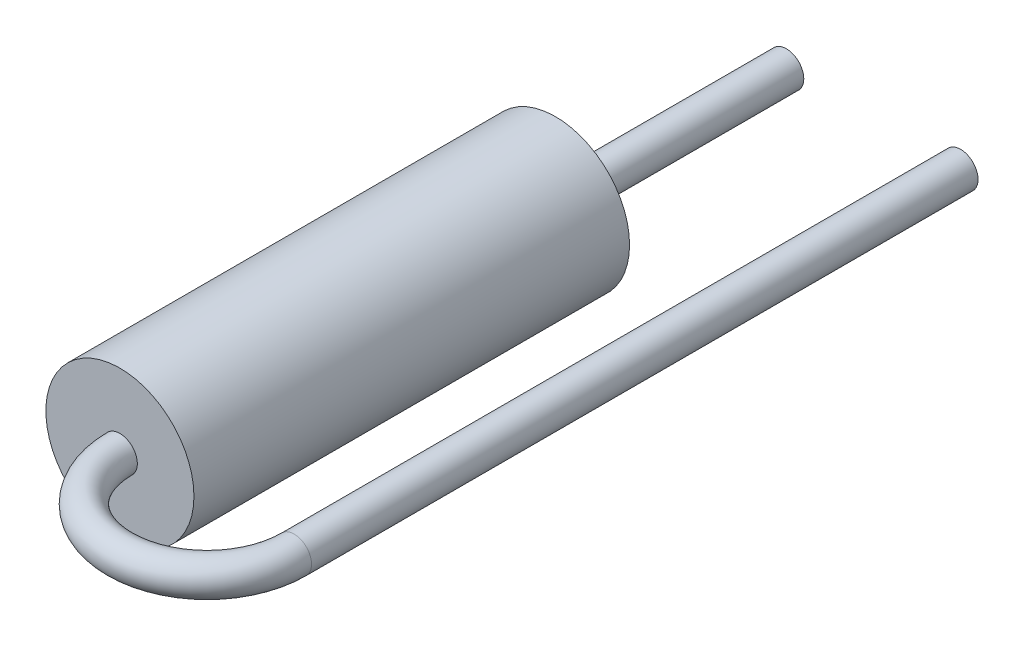
ISO-10303-21;
HEADER;
FILE_DESCRIPTION(('STEP AP214'),'2;1');
FILE_NAME('part.step','',(''),(''),'','','');
FILE_SCHEMA(('AUTOMOTIVE_DESIGN { 1 0 10303 214 1 1 1 1 }'));
ENDSEC;
DATA;
#1=APPLICATION_CONTEXT('core data for automotive mechanical design processes');
#2=APPLICATION_PROTOCOL_DEFINITION('international standard','automotive_design',2000,#1);
#3=PRODUCT_CONTEXT('',#1,'mechanical');
#4=PRODUCT('Part','Part','',(#3));
#5=PRODUCT_RELATED_PRODUCT_CATEGORY('part','',(#4));
#6=PRODUCT_DEFINITION_FORMATION('','',#4);
#7=PRODUCT_DEFINITION_CONTEXT('part definition',#1,'design');
#8=PRODUCT_DEFINITION('design','',#6,#7);
#9=PRODUCT_DEFINITION_SHAPE('','',#8);
#10=(LENGTH_UNIT() NAMED_UNIT(*) SI_UNIT(.MILLI.,.METRE.));
#11=(NAMED_UNIT(*) PLANE_ANGLE_UNIT() SI_UNIT($,.RADIAN.));
#12=(NAMED_UNIT(*) SI_UNIT($,.STERADIAN.) SOLID_ANGLE_UNIT());
#13=UNCERTAINTY_MEASURE_WITH_UNIT(LENGTH_MEASURE(1.E-05),#10,'distance_accuracy_value','');
#14=(GEOMETRIC_REPRESENTATION_CONTEXT(3) GLOBAL_UNCERTAINTY_ASSIGNED_CONTEXT((#13)) GLOBAL_UNIT_ASSIGNED_CONTEXT((#10,
#11,#12)) REPRESENTATION_CONTEXT('',''));
#15=CARTESIAN_POINT('',(0.,0.,0.));
#16=DIRECTION('',(0.,0.,1.));
#17=DIRECTION('',(1.,0.,0.));
#18=AXIS2_PLACEMENT_3D('',#15,#16,#17);
#19=CARTESIAN_POINT('',(0.,0.,0.));
#20=DIRECTION('',(0.,0.,1.));
#21=DIRECTION('',(1.,0.,0.));
#22=AXIS2_PLACEMENT_3D('',#19,#20,#21);
#23=PLANE('',#22);
#24=CARTESIAN_POINT('',(0.,0.,0.));
#25=DIRECTION('',(0.,0.,1.));
#26=DIRECTION('',(1.,0.,0.));
#27=AXIS2_PLACEMENT_3D('',#24,#25,#26);
#28=CIRCLE('',#27,1.7);
#29=CARTESIAN_POINT('',(1.7,0.,0.));
#30=VERTEX_POINT('',#29);
#31=EDGE_CURVE('E50',#30,#30,#28,.T.);
#32=ORIENTED_EDGE('',*,*,#31,.F.);
#33=EDGE_LOOP('',(#32));
#34=FACE_BOUND('',#33,.T.);
#35=CARTESIAN_POINT('',(0.,0.,0.));
#36=DIRECTION('',(0.,0.,1.));
#37=DIRECTION('',(1.,0.,0.));
#38=AXIS2_PLACEMENT_3D('',#35,#36,#37);
#39=CIRCLE('',#38,0.4);
#40=CARTESIAN_POINT('',(0.4,0.,0.));
#41=VERTEX_POINT('',#40);
#42=EDGE_CURVE('E10',#41,#41,#39,.F.);
#43=ORIENTED_EDGE('',*,*,#42,.F.);
#44=EDGE_LOOP('',(#43));
#45=FACE_BOUND('',#44,.T.);
#46=ADVANCED_FACE('F34',(#34,#45),#23,.F.);
#47=CARTESIAN_POINT('',(0.,0.,10.));
#48=DIRECTION('',(0.,0.,-1.));
#49=DIRECTION('',(-1.,0.,0.));
#50=AXIS2_PLACEMENT_3D('',#47,#48,#49);
#51=CYLINDRICAL_SURFACE('',#50,1.7);
#52=CARTESIAN_POINT('',(0.,0.,10.));
#53=DIRECTION('',(0.,0.,1.));
#54=DIRECTION('',(1.,0.,0.));
#55=AXIS2_PLACEMENT_3D('',#52,#53,#54);
#56=CIRCLE('',#55,1.7);
#57=CARTESIAN_POINT('',(1.7,0.,10.));
#58=VERTEX_POINT('',#57);
#59=EDGE_CURVE('E45',#58,#58,#56,.T.);
#60=ORIENTED_EDGE('',*,*,#59,.F.);
#61=EDGE_LOOP('',(#60));
#62=FACE_BOUND('',#61,.T.);
#63=ORIENTED_EDGE('',*,*,#31,.T.);
#64=EDGE_LOOP('',(#63));
#65=FACE_BOUND('',#64,.T.);
#66=ADVANCED_FACE('F36',(#62,#65),#51,.T.);
#67=CARTESIAN_POINT('',(0.,0.,10.));
#68=DIRECTION('',(0.,0.,1.));
#69=DIRECTION('',(1.,0.,0.));
#70=AXIS2_PLACEMENT_3D('',#67,#68,#69);
#71=PLANE('',#70);
#72=CARTESIAN_POINT('',(0.,0.,10.));
#73=DIRECTION('',(0.,0.,1.));
#74=DIRECTION('',(1.,0.,0.));
#75=AXIS2_PLACEMENT_3D('',#72,#73,#74);
#76=CIRCLE('',#75,0.4);
#77=CARTESIAN_POINT('',(-0.4,0.,10.));
#78=VERTEX_POINT('',#77);
#79=EDGE_CURVE('E41',#78,#78,#76,.T.);
#80=ORIENTED_EDGE('',*,*,#79,.F.);
#81=EDGE_LOOP('',(#80));
#82=FACE_BOUND('',#81,.T.);
#83=ORIENTED_EDGE('',*,*,#59,.T.);
#84=EDGE_LOOP('',(#83));
#85=FACE_BOUND('',#84,.T.);
#86=ADVANCED_FACE('F69',(#82,#85),#71,.T.);
#87=CARTESIAN_POINT('',(4.,0.,10.));
#88=DIRECTION('',(0.,0.,-1.));
#89=DIRECTION('',(-1.,0.,0.));
#90=AXIS2_PLACEMENT_3D('',#87,#88,#89);
#91=CYLINDRICAL_SURFACE('',#90,0.4);
#92=CARTESIAN_POINT('',(4.,0.,10.));
#93=DIRECTION('',(0.,0.,-1.));
#94=DIRECTION('',(-1.,0.,0.));
#95=AXIS2_PLACEMENT_3D('',#92,#93,#94);
#96=CIRCLE('',#95,0.4);
#97=CARTESIAN_POINT('',(4.4,0.,10.));
#98=VERTEX_POINT('',#97);
#99=EDGE_CURVE('E55',#98,#98,#96,.T.);
#100=ORIENTED_EDGE('',*,*,#99,.T.);
#101=EDGE_LOOP('',(#100));
#102=FACE_BOUND('',#101,.T.);
#103=CARTESIAN_POINT('',(4.,0.,-5.3));
#104=DIRECTION('',(0.,0.,-1.));
#105=DIRECTION('',(-1.,0.,0.));
#106=AXIS2_PLACEMENT_3D('',#103,#104,#105);
#107=CIRCLE('',#106,0.4);
#108=CARTESIAN_POINT('',(3.6,0.,-5.3));
#109=VERTEX_POINT('',#108);
#110=EDGE_CURVE('E58',#109,#109,#107,.T.);
#111=ORIENTED_EDGE('',*,*,#110,.F.);
#112=EDGE_LOOP('',(#111));
#113=FACE_BOUND('',#112,.T.);
#114=ADVANCED_FACE('F74',(#102,#113),#91,.T.);
#115=CARTESIAN_POINT('',(2.,0.,10.));
#116=DIRECTION('',(0.,-1.,0.));
#117=DIRECTION('',(0.,0.,-1.));
#118=AXIS2_PLACEMENT_3D('',#115,#116,#117);
#119=TOROIDAL_SURFACE('',#118,2.,0.4);
#120=CARTESIAN_POINT('',(2.,0.,10.));
#121=DIRECTION('',(0.,-1.,0.));
#122=DIRECTION('',(0.,0.,-1.));
#123=AXIS2_PLACEMENT_3D('',#120,#121,#122);
#124=CIRCLE('',#123,2.4);
#125=EDGE_CURVE('',#98,#78,#124,.T.);
#126=ORIENTED_EDGE('',*,*,#99,.F.);
#127=ORIENTED_EDGE('',*,*,#79,.T.);
#128=ORIENTED_EDGE('',*,*,#125,.T.);
#129=ORIENTED_EDGE('',*,*,#125,.F.);
#130=EDGE_LOOP('',(#126,#128,#127,#129));
#131=FACE_BOUND('',#130,.T.);
#132=ADVANCED_FACE('F78',(#131),#119,.T.);
#133=CARTESIAN_POINT('',(4.,0.,-5.3));
#134=DIRECTION('',(0.,0.,-1.));
#135=DIRECTION('',(-1.,0.,0.));
#136=AXIS2_PLACEMENT_3D('',#133,#134,#135);
#137=PLANE('',#136);
#138=ORIENTED_EDGE('',*,*,#110,.T.);
#139=EDGE_LOOP('',(#138));
#140=FACE_BOUND('',#139,.T.);
#141=ADVANCED_FACE('F80',(#140),#137,.T.);
#142=CARTESIAN_POINT('',(0.,0.,-6.43137084989848));
#143=DIRECTION('',(0.,0.,1.));
#144=DIRECTION('',(1.,0.,0.));
#145=AXIS2_PLACEMENT_3D('',#142,#143,#144);
#146=CYLINDRICAL_SURFACE('',#145,0.4);
#147=ORIENTED_EDGE('',*,*,#42,.T.);
#148=EDGE_LOOP('',(#147));
#149=FACE_BOUND('',#148,.T.);
#150=CARTESIAN_POINT('',(0.,0.,-5.3));
#151=DIRECTION('',(0.,0.,-1.));
#152=DIRECTION('',(-1.,0.,0.));
#153=AXIS2_PLACEMENT_3D('',#150,#151,#152);
#154=CIRCLE('',#153,0.4);
#155=CARTESIAN_POINT('',(-0.4,0.,-5.3));
#156=VERTEX_POINT('',#155);
#157=EDGE_CURVE('E54',#156,#156,#154,.T.);
#158=ORIENTED_EDGE('',*,*,#157,.F.);
#159=EDGE_LOOP('',(#158));
#160=FACE_BOUND('',#159,.T.);
#161=ADVANCED_FACE('F84',(#149,#160),#146,.T.);
#162=CARTESIAN_POINT('',(4.,0.,-5.3));
#163=DIRECTION('',(0.,0.,-1.));
#164=DIRECTION('',(-1.,0.,0.));
#165=AXIS2_PLACEMENT_3D('',#162,#163,#164);
#166=PLANE('',#165);
#167=ORIENTED_EDGE('',*,*,#157,.T.);
#168=EDGE_LOOP('',(#167));
#169=FACE_BOUND('',#168,.T.);
#170=ADVANCED_FACE('F88',(#169),#166,.T.);
#171=CLOSED_SHELL('',(#46,#66,#86,#114,#132,#141,#161,#170));
#172=MANIFOLD_SOLID_BREP('B2',#171);
#173=ADVANCED_BREP_SHAPE_REPRESENTATION('',(#18,#172),#14);
#174=SHAPE_DEFINITION_REPRESENTATION(#9,#173);
ENDSEC;
END-ISO-10303-21;
